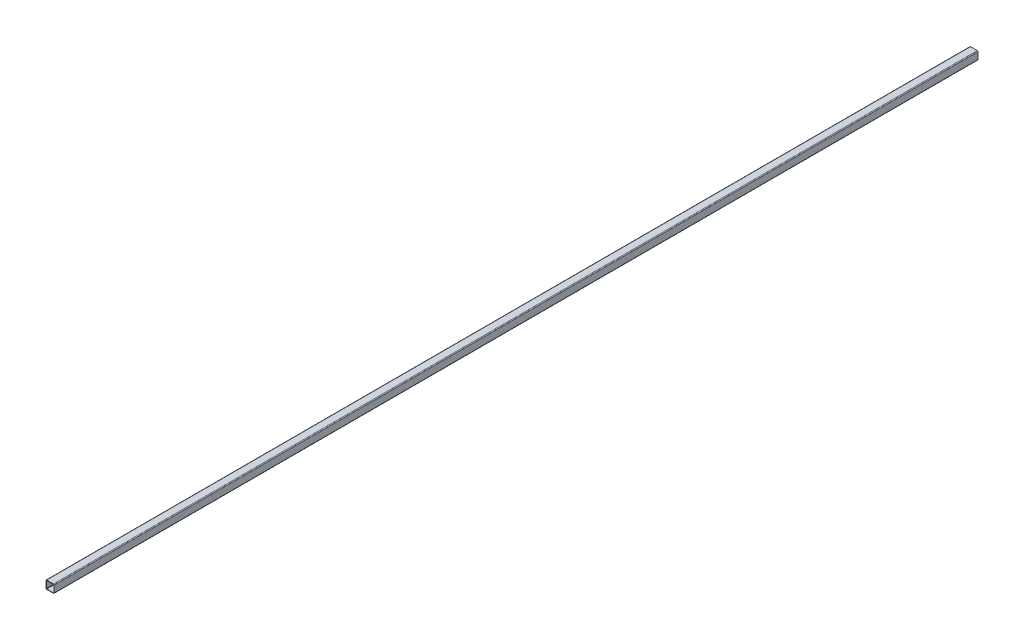
ISO-10303-21;
HEADER;
FILE_DESCRIPTION(('STEP AP214'),'2;1');
FILE_NAME('part.step','',(''),(''),'','','');
FILE_SCHEMA(('AUTOMOTIVE_DESIGN { 1 0 10303 214 1 1 1 1 }'));
ENDSEC;
DATA;
#1=APPLICATION_CONTEXT('core data for automotive mechanical design processes');
#2=APPLICATION_PROTOCOL_DEFINITION('international standard','automotive_design',2000,#1);
#3=PRODUCT_CONTEXT('',#1,'mechanical');
#4=PRODUCT('Part','Part','',(#3));
#5=PRODUCT_RELATED_PRODUCT_CATEGORY('part','',(#4));
#6=PRODUCT_DEFINITION_FORMATION('','',#4);
#7=PRODUCT_DEFINITION_CONTEXT('part definition',#1,'design');
#8=PRODUCT_DEFINITION('design','',#6,#7);
#9=PRODUCT_DEFINITION_SHAPE('','',#8);
#10=(LENGTH_UNIT() NAMED_UNIT(*) SI_UNIT(.MILLI.,.METRE.));
#11=(NAMED_UNIT(*) PLANE_ANGLE_UNIT() SI_UNIT($,.RADIAN.));
#12=(NAMED_UNIT(*) SI_UNIT($,.STERADIAN.) SOLID_ANGLE_UNIT());
#13=UNCERTAINTY_MEASURE_WITH_UNIT(LENGTH_MEASURE(1.E-05),#10,'distance_accuracy_value','');
#14=(GEOMETRIC_REPRESENTATION_CONTEXT(3) GLOBAL_UNCERTAINTY_ASSIGNED_CONTEXT((#13)) GLOBAL_UNIT_ASSIGNED_CONTEXT((#10,
#11,#12)) REPRESENTATION_CONTEXT('',''));
#15=CARTESIAN_POINT('',(0.,0.,0.));
#16=DIRECTION('',(0.,0.,1.));
#17=DIRECTION('',(1.,0.,0.));
#18=AXIS2_PLACEMENT_3D('',#15,#16,#17);
#19=CARTESIAN_POINT('',(-11.2903,-11.2903,1563.6875));
#20=DIRECTION('',(0.,0.,1.));
#21=DIRECTION('',(1.,0.,0.));
#22=AXIS2_PLACEMENT_3D('',#19,#20,#21);
#23=PLANE('',#22);
#24=CARTESIAN_POINT('',(-11.2903,-11.2903,1563.6875));
#25=DIRECTION('',(0.,0.,1.));
#26=DIRECTION('',(1.,0.,0.));
#27=AXIS2_PLACEMENT_3D('',#24,#25,#26);
#28=CIRCLE('',#27,2.54);
#29=CARTESIAN_POINT('',(-13.8303,-11.2903,1563.6875));
#30=VERTEX_POINT('',#29);
#31=CARTESIAN_POINT('',(-11.2903,-13.8303,1563.6875));
#32=VERTEX_POINT('',#31);
#33=EDGE_CURVE('E211',#30,#32,#28,.T.);
#34=ORIENTED_EDGE('',*,*,#33,.T.);
#35=DIRECTION('',(1.,0.,0.));
#36=VECTOR('',#35,1.);
#37=CARTESIAN_POINT('',(-11.2903,-13.8303,1563.6875));
#38=LINE('',#37,#36);
#39=CARTESIAN_POINT('',(11.2903,-13.8303,1563.6875));
#40=VERTEX_POINT('',#39);
#41=EDGE_CURVE('E214',#32,#40,#38,.T.);
#42=ORIENTED_EDGE('',*,*,#41,.T.);
#43=CARTESIAN_POINT('',(11.2903,-11.2903,1563.6875));
#44=DIRECTION('',(0.,0.,1.));
#45=DIRECTION('',(1.,0.,0.));
#46=AXIS2_PLACEMENT_3D('',#43,#44,#45);
#47=CIRCLE('',#46,2.53999999999999);
#48=CARTESIAN_POINT('',(13.8303,-11.2903,1563.6875));
#49=VERTEX_POINT('',#48);
#50=EDGE_CURVE('E217',#40,#49,#47,.T.);
#51=ORIENTED_EDGE('',*,*,#50,.T.);
#52=DIRECTION('',(0.,1.,0.));
#53=VECTOR('',#52,1.);
#54=CARTESIAN_POINT('',(13.8303,11.2903,1563.6875));
#55=LINE('',#54,#53);
#56=CARTESIAN_POINT('',(13.8303,11.2903,1563.6875));
#57=VERTEX_POINT('',#56);
#58=EDGE_CURVE('E219',#49,#57,#55,.T.);
#59=ORIENTED_EDGE('',*,*,#58,.T.);
#60=CARTESIAN_POINT('',(11.2903,11.2903,1563.6875));
#61=DIRECTION('',(0.,0.,1.));
#62=DIRECTION('',(-1.,0.,0.));
#63=AXIS2_PLACEMENT_3D('',#60,#61,#62);
#64=CIRCLE('',#63,2.53999999999999);
#65=CARTESIAN_POINT('',(11.2903,13.8303,1563.6875));
#66=VERTEX_POINT('',#65);
#67=EDGE_CURVE('E221',#57,#66,#64,.T.);
#68=ORIENTED_EDGE('',*,*,#67,.T.);
#69=DIRECTION('',(-1.,0.,0.));
#70=VECTOR('',#69,1.);
#71=CARTESIAN_POINT('',(-11.2903,13.8303,1563.6875));
#72=LINE('',#71,#70);
#73=CARTESIAN_POINT('',(-11.2903,13.8303,1563.6875));
#74=VERTEX_POINT('',#73);
#75=EDGE_CURVE('E223',#66,#74,#72,.T.);
#76=ORIENTED_EDGE('',*,*,#75,.T.);
#77=CARTESIAN_POINT('',(-11.2903,11.2903,1563.6875));
#78=DIRECTION('',(0.,0.,1.));
#79=DIRECTION('',(1.,0.,0.));
#80=AXIS2_PLACEMENT_3D('',#77,#78,#79);
#81=CIRCLE('',#80,2.54);
#82=CARTESIAN_POINT('',(-13.8303,11.2903,1563.6875));
#83=VERTEX_POINT('',#82);
#84=EDGE_CURVE('E225',#74,#83,#81,.T.);
#85=ORIENTED_EDGE('',*,*,#84,.T.);
#86=DIRECTION('',(0.,-1.,0.));
#87=VECTOR('',#86,1.);
#88=CARTESIAN_POINT('',(-13.8303,11.2903,1563.6875));
#89=LINE('',#88,#87);
#90=EDGE_CURVE('E227',#83,#30,#89,.T.);
#91=ORIENTED_EDGE('',*,*,#90,.T.);
#92=EDGE_LOOP('',(#34,#42,#51,#59,#68,#76,#85,#91));
#93=FACE_BOUND('',#92,.T.);
#94=DIRECTION('',(0.,-1.,0.));
#95=VECTOR('',#94,1.);
#96=CARTESIAN_POINT('',(-12.5603,11.2903,1563.6875));
#97=LINE('',#96,#95);
#98=CARTESIAN_POINT('',(-12.5603,11.2903,1563.6875));
#99=VERTEX_POINT('',#98);
#100=CARTESIAN_POINT('',(-12.5603,-11.2903,1563.6875));
#101=VERTEX_POINT('',#100);
#102=EDGE_CURVE('E154',#99,#101,#97,.T.);
#103=ORIENTED_EDGE('',*,*,#102,.F.);
#104=CARTESIAN_POINT('',(-11.2903,11.2903,1563.6875));
#105=DIRECTION('',(0.,0.,1.));
#106=DIRECTION('',(1.,0.,0.));
#107=AXIS2_PLACEMENT_3D('',#104,#105,#106);
#108=CIRCLE('',#107,1.27);
#109=CARTESIAN_POINT('',(-11.2903,12.5603,1563.6875));
#110=VERTEX_POINT('',#109);
#111=EDGE_CURVE('E146',#110,#99,#108,.T.);
#112=ORIENTED_EDGE('',*,*,#111,.F.);
#113=DIRECTION('',(-1.,0.,0.));
#114=VECTOR('',#113,1.);
#115=CARTESIAN_POINT('',(-11.2903,12.5603,1563.6875));
#116=LINE('',#115,#114);
#117=CARTESIAN_POINT('',(11.2903,12.5603,1563.6875));
#118=VERTEX_POINT('',#117);
#119=EDGE_CURVE('E179',#118,#110,#116,.T.);
#120=ORIENTED_EDGE('',*,*,#119,.F.);
#121=CARTESIAN_POINT('',(11.2903,11.2903,1563.6875));
#122=DIRECTION('',(0.,0.,1.));
#123=DIRECTION('',(-1.,0.,0.));
#124=AXIS2_PLACEMENT_3D('',#121,#122,#123);
#125=CIRCLE('',#124,1.26999999999999);
#126=CARTESIAN_POINT('',(12.5603,11.2903,1563.6875));
#127=VERTEX_POINT('',#126);
#128=EDGE_CURVE('E177',#127,#118,#125,.T.);
#129=ORIENTED_EDGE('',*,*,#128,.F.);
#130=DIRECTION('',(0.,1.,0.));
#131=VECTOR('',#130,1.);
#132=CARTESIAN_POINT('',(12.5603,11.2903,1563.6875));
#133=LINE('',#132,#131);
#134=CARTESIAN_POINT('',(12.5603,-11.2903,1563.6875));
#135=VERTEX_POINT('',#134);
#136=EDGE_CURVE('E175',#135,#127,#133,.T.);
#137=ORIENTED_EDGE('',*,*,#136,.F.);
#138=CARTESIAN_POINT('',(11.2903,-11.2903,1563.6875));
#139=DIRECTION('',(0.,0.,1.));
#140=DIRECTION('',(1.,0.,0.));
#141=AXIS2_PLACEMENT_3D('',#138,#139,#140);
#142=CIRCLE('',#141,1.27);
#143=CARTESIAN_POINT('',(11.2903,-12.5603,1563.6875));
#144=VERTEX_POINT('',#143);
#145=EDGE_CURVE('E173',#144,#135,#142,.T.);
#146=ORIENTED_EDGE('',*,*,#145,.F.);
#147=DIRECTION('',(1.,0.,0.));
#148=VECTOR('',#147,1.);
#149=CARTESIAN_POINT('',(-11.2903,-12.5603,1563.6875));
#150=LINE('',#149,#148);
#151=CARTESIAN_POINT('',(-11.2903,-12.5603,1563.6875));
#152=VERTEX_POINT('',#151);
#153=EDGE_CURVE('E169',#152,#144,#150,.T.);
#154=ORIENTED_EDGE('',*,*,#153,.F.);
#155=CARTESIAN_POINT('',(-11.2903,-11.2903,1563.6875));
#156=DIRECTION('',(0.,0.,1.));
#157=DIRECTION('',(1.,0.,0.));
#158=AXIS2_PLACEMENT_3D('',#155,#156,#157);
#159=CIRCLE('',#158,1.27);
#160=EDGE_CURVE('E167',#101,#152,#159,.T.);
#161=ORIENTED_EDGE('',*,*,#160,.F.);
#162=EDGE_LOOP('',(#103,#112,#120,#129,#137,#146,#154,#161));
#163=FACE_BOUND('',#162,.T.);
#164=ADVANCED_FACE('F33',(#93,#163),#23,.T.);
#165=CARTESIAN_POINT('',(-11.2903,-11.2903,-1563.6875));
#166=DIRECTION('',(0.,0.,1.));
#167=DIRECTION('',(1.,0.,0.));
#168=AXIS2_PLACEMENT_3D('',#165,#166,#167);
#169=PLANE('',#168);
#170=CARTESIAN_POINT('',(-11.2903,-11.2903,-1563.6875));
#171=DIRECTION('',(0.,0.,1.));
#172=DIRECTION('',(1.,0.,0.));
#173=AXIS2_PLACEMENT_3D('',#170,#171,#172);
#174=CIRCLE('',#173,2.54);
#175=CARTESIAN_POINT('',(-13.8303,-11.2903,-1563.6875));
#176=VERTEX_POINT('',#175);
#177=CARTESIAN_POINT('',(-11.2903,-13.8303,-1563.6875));
#178=VERTEX_POINT('',#177);
#179=EDGE_CURVE('E162',#176,#178,#174,.T.);
#180=ORIENTED_EDGE('',*,*,#179,.F.);
#181=DIRECTION('',(0.,-1.,0.));
#182=VECTOR('',#181,1.);
#183=CARTESIAN_POINT('',(-13.8303,11.2903,-1563.6875));
#184=LINE('',#183,#182);
#185=CARTESIAN_POINT('',(-13.8303,11.2903,-1563.6875));
#186=VERTEX_POINT('',#185);
#187=EDGE_CURVE('E215',#186,#176,#184,.T.);
#188=ORIENTED_EDGE('',*,*,#187,.F.);
#189=CARTESIAN_POINT('',(-11.2903,11.2903,-1563.6875));
#190=DIRECTION('',(0.,0.,1.));
#191=DIRECTION('',(1.,0.,0.));
#192=AXIS2_PLACEMENT_3D('',#189,#190,#191);
#193=CIRCLE('',#192,2.54);
#194=CARTESIAN_POINT('',(-11.2903,13.8303,-1563.6875));
#195=VERTEX_POINT('',#194);
#196=EDGE_CURVE('E242',#195,#186,#193,.T.);
#197=ORIENTED_EDGE('',*,*,#196,.F.);
#198=DIRECTION('',(-1.,0.,0.));
#199=VECTOR('',#198,1.);
#200=CARTESIAN_POINT('',(-11.2903,13.8303,-1563.6875));
#201=LINE('',#200,#199);
#202=CARTESIAN_POINT('',(11.2903,13.8303,-1563.6875));
#203=VERTEX_POINT('',#202);
#204=EDGE_CURVE('E240',#203,#195,#201,.T.);
#205=ORIENTED_EDGE('',*,*,#204,.F.);
#206=CARTESIAN_POINT('',(11.2903,11.2903,-1563.6875));
#207=DIRECTION('',(0.,0.,1.));
#208=DIRECTION('',(-1.,0.,0.));
#209=AXIS2_PLACEMENT_3D('',#206,#207,#208);
#210=CIRCLE('',#209,2.53999999999999);
#211=CARTESIAN_POINT('',(13.8303,11.2903,-1563.6875));
#212=VERTEX_POINT('',#211);
#213=EDGE_CURVE('E238',#212,#203,#210,.T.);
#214=ORIENTED_EDGE('',*,*,#213,.F.);
#215=DIRECTION('',(0.,1.,0.));
#216=VECTOR('',#215,1.);
#217=CARTESIAN_POINT('',(13.8303,11.2903,-1563.6875));
#218=LINE('',#217,#216);
#219=CARTESIAN_POINT('',(13.8303,-11.2903,-1563.6875));
#220=VERTEX_POINT('',#219);
#221=EDGE_CURVE('E236',#220,#212,#218,.T.);
#222=ORIENTED_EDGE('',*,*,#221,.F.);
#223=CARTESIAN_POINT('',(11.2903,-11.2903,-1563.6875));
#224=DIRECTION('',(0.,0.,1.));
#225=DIRECTION('',(1.,0.,0.));
#226=AXIS2_PLACEMENT_3D('',#223,#224,#225);
#227=CIRCLE('',#226,2.53999999999999);
#228=CARTESIAN_POINT('',(11.2903,-13.8303,-1563.6875));
#229=VERTEX_POINT('',#228);
#230=EDGE_CURVE('E234',#229,#220,#227,.T.);
#231=ORIENTED_EDGE('',*,*,#230,.F.);
#232=DIRECTION('',(1.,0.,0.));
#233=VECTOR('',#232,1.);
#234=CARTESIAN_POINT('',(-11.2903,-13.8303,-1563.6875));
#235=LINE('',#234,#233);
#236=EDGE_CURVE('E232',#178,#229,#235,.T.);
#237=ORIENTED_EDGE('',*,*,#236,.F.);
#238=EDGE_LOOP('',(#180,#188,#197,#205,#214,#222,#231,#237));
#239=FACE_BOUND('',#238,.T.);
#240=CARTESIAN_POINT('',(-11.2903,11.2903,-1563.6875));
#241=DIRECTION('',(0.,0.,1.));
#242=DIRECTION('',(1.,0.,0.));
#243=AXIS2_PLACEMENT_3D('',#240,#241,#242);
#244=CIRCLE('',#243,1.27);
#245=CARTESIAN_POINT('',(-11.2903,12.5603,-1563.6875));
#246=VERTEX_POINT('',#245);
#247=CARTESIAN_POINT('',(-12.5603,11.2903,-1563.6875));
#248=VERTEX_POINT('',#247);
#249=EDGE_CURVE('E56',#246,#248,#244,.T.);
#250=ORIENTED_EDGE('',*,*,#249,.T.);
#251=DIRECTION('',(0.,-1.,0.));
#252=VECTOR('',#251,1.);
#253=CARTESIAN_POINT('',(-12.5603,11.2903,-1563.6875));
#254=LINE('',#253,#252);
#255=CARTESIAN_POINT('',(-12.5603,-11.2903,-1563.6875));
#256=VERTEX_POINT('',#255);
#257=EDGE_CURVE('E161',#248,#256,#254,.T.);
#258=ORIENTED_EDGE('',*,*,#257,.T.);
#259=CARTESIAN_POINT('',(-11.2903,-11.2903,-1563.6875));
#260=DIRECTION('',(0.,0.,1.));
#261=DIRECTION('',(1.,0.,0.));
#262=AXIS2_PLACEMENT_3D('',#259,#260,#261);
#263=CIRCLE('',#262,1.27);
#264=CARTESIAN_POINT('',(-11.2903,-12.5603,-1563.6875));
#265=VERTEX_POINT('',#264);
#266=EDGE_CURVE('E183',#256,#265,#263,.T.);
#267=ORIENTED_EDGE('',*,*,#266,.T.);
#268=DIRECTION('',(1.,0.,0.));
#269=VECTOR('',#268,1.);
#270=CARTESIAN_POINT('',(-11.2903,-12.5603,-1563.6875));
#271=LINE('',#270,#269);
#272=CARTESIAN_POINT('',(11.2903,-12.5603,-1563.6875));
#273=VERTEX_POINT('',#272);
#274=EDGE_CURVE('E186',#265,#273,#271,.T.);
#275=ORIENTED_EDGE('',*,*,#274,.T.);
#276=CARTESIAN_POINT('',(11.2903,-11.2903,-1563.6875));
#277=DIRECTION('',(0.,0.,1.));
#278=DIRECTION('',(1.,0.,0.));
#279=AXIS2_PLACEMENT_3D('',#276,#277,#278);
#280=CIRCLE('',#279,1.27);
#281=CARTESIAN_POINT('',(12.5603,-11.2903,-1563.6875));
#282=VERTEX_POINT('',#281);
#283=EDGE_CURVE('E189',#273,#282,#280,.T.);
#284=ORIENTED_EDGE('',*,*,#283,.T.);
#285=DIRECTION('',(0.,1.,0.));
#286=VECTOR('',#285,1.);
#287=CARTESIAN_POINT('',(12.5603,11.2903,-1563.6875));
#288=LINE('',#287,#286);
#289=CARTESIAN_POINT('',(12.5603,11.2903,-1563.6875));
#290=VERTEX_POINT('',#289);
#291=EDGE_CURVE('E192',#282,#290,#288,.T.);
#292=ORIENTED_EDGE('',*,*,#291,.T.);
#293=CARTESIAN_POINT('',(11.2903,11.2903,-1563.6875));
#294=DIRECTION('',(0.,0.,1.));
#295=DIRECTION('',(-1.,0.,0.));
#296=AXIS2_PLACEMENT_3D('',#293,#294,#295);
#297=CIRCLE('',#296,1.26999999999999);
#298=CARTESIAN_POINT('',(11.2903,12.5603,-1563.6875));
#299=VERTEX_POINT('',#298);
#300=EDGE_CURVE('E195',#290,#299,#297,.T.);
#301=ORIENTED_EDGE('',*,*,#300,.T.);
#302=DIRECTION('',(-1.,0.,0.));
#303=VECTOR('',#302,1.);
#304=CARTESIAN_POINT('',(-11.2903,12.5603,-1563.6875));
#305=LINE('',#304,#303);
#306=EDGE_CURVE('E155',#299,#246,#305,.T.);
#307=ORIENTED_EDGE('',*,*,#306,.T.);
#308=EDGE_LOOP('',(#250,#258,#267,#275,#284,#292,#301,#307));
#309=FACE_BOUND('',#308,.T.);
#310=ADVANCED_FACE('F272',(#239,#309),#169,.F.);
#311=CARTESIAN_POINT('',(-11.2903,-11.2903,1563.6875));
#312=DIRECTION('',(0.,0.,-1.));
#313=DIRECTION('',(-1.,0.,0.));
#314=AXIS2_PLACEMENT_3D('',#311,#312,#313);
#315=CYLINDRICAL_SURFACE('',#314,2.54);
#316=ORIENTED_EDGE('',*,*,#179,.T.);
#317=DIRECTION('',(0.,0.,-1.));
#318=VECTOR('',#317,1.);
#319=CARTESIAN_POINT('',(-11.2903,-13.8303,1563.6875));
#320=LINE('',#319,#318);
#321=EDGE_CURVE('E11',#32,#178,#320,.T.);
#322=ORIENTED_EDGE('',*,*,#321,.F.);
#323=ORIENTED_EDGE('',*,*,#33,.F.);
#324=DIRECTION('',(0.,0.,-1.));
#325=VECTOR('',#324,1.);
#326=CARTESIAN_POINT('',(-13.8303,-11.2903,1563.6875));
#327=LINE('',#326,#325);
#328=EDGE_CURVE('E229',#30,#176,#327,.T.);
#329=ORIENTED_EDGE('',*,*,#328,.T.);
#330=EDGE_LOOP('',(#316,#322,#323,#329));
#331=FACE_BOUND('',#330,.T.);
#332=ADVANCED_FACE('F35',(#331),#315,.T.);
#333=CARTESIAN_POINT('',(-11.2903,-13.8303,1563.6875));
#334=DIRECTION('',(0.,1.,0.));
#335=DIRECTION('',(0.,0.,1.));
#336=AXIS2_PLACEMENT_3D('',#333,#334,#335);
#337=PLANE('',#336);
#338=ORIENTED_EDGE('',*,*,#236,.T.);
#339=DIRECTION('',(0.,0.,-1.));
#340=VECTOR('',#339,1.);
#341=CARTESIAN_POINT('',(11.2903,-13.8303,1563.6875));
#342=LINE('',#341,#340);
#343=EDGE_CURVE('E41',#40,#229,#342,.T.);
#344=ORIENTED_EDGE('',*,*,#343,.F.);
#345=ORIENTED_EDGE('',*,*,#41,.F.);
#346=ORIENTED_EDGE('',*,*,#321,.T.);
#347=EDGE_LOOP('',(#338,#344,#345,#346));
#348=FACE_BOUND('',#347,.T.);
#349=ADVANCED_FACE('F289',(#348),#337,.F.);
#350=CARTESIAN_POINT('',(11.2903,-11.2903,1563.6875));
#351=DIRECTION('',(0.,0.,-1.));
#352=DIRECTION('',(-1.,0.,0.));
#353=AXIS2_PLACEMENT_3D('',#350,#351,#352);
#354=CYLINDRICAL_SURFACE('',#353,2.53999999999999);
#355=ORIENTED_EDGE('',*,*,#230,.T.);
#356=DIRECTION('',(0.,0.,-1.));
#357=VECTOR('',#356,1.);
#358=CARTESIAN_POINT('',(13.8303,-11.2903,1563.6875));
#359=LINE('',#358,#357);
#360=EDGE_CURVE('E259',#49,#220,#359,.T.);
#361=ORIENTED_EDGE('',*,*,#360,.F.);
#362=ORIENTED_EDGE('',*,*,#50,.F.);
#363=ORIENTED_EDGE('',*,*,#343,.T.);
#364=EDGE_LOOP('',(#355,#361,#362,#363));
#365=FACE_BOUND('',#364,.T.);
#366=ADVANCED_FACE('F266',(#365),#354,.T.);
#367=CARTESIAN_POINT('',(13.8303,11.2903,1563.6875));
#368=DIRECTION('',(-1.,0.,0.));
#369=DIRECTION('',(0.,0.,1.));
#370=AXIS2_PLACEMENT_3D('',#367,#368,#369);
#371=PLANE('',#370);
#372=ORIENTED_EDGE('',*,*,#221,.T.);
#373=DIRECTION('',(0.,0.,-1.));
#374=VECTOR('',#373,1.);
#375=CARTESIAN_POINT('',(13.8303,11.2903,1563.6875));
#376=LINE('',#375,#374);
#377=EDGE_CURVE('E256',#57,#212,#376,.T.);
#378=ORIENTED_EDGE('',*,*,#377,.F.);
#379=ORIENTED_EDGE('',*,*,#58,.F.);
#380=ORIENTED_EDGE('',*,*,#360,.T.);
#381=EDGE_LOOP('',(#372,#378,#379,#380));
#382=FACE_BOUND('',#381,.T.);
#383=ADVANCED_FACE('F278',(#382),#371,.F.);
#384=CARTESIAN_POINT('',(11.2903,11.2903,1563.6875));
#385=DIRECTION('',(0.,0.,-1.));
#386=DIRECTION('',(-1.,0.,0.));
#387=AXIS2_PLACEMENT_3D('',#384,#385,#386);
#388=CYLINDRICAL_SURFACE('',#387,2.53999999999999);
#389=ORIENTED_EDGE('',*,*,#213,.T.);
#390=DIRECTION('',(0.,0.,-1.));
#391=VECTOR('',#390,1.);
#392=CARTESIAN_POINT('',(11.2903,13.8303,1563.6875));
#393=LINE('',#392,#391);
#394=EDGE_CURVE('E253',#66,#203,#393,.T.);
#395=ORIENTED_EDGE('',*,*,#394,.F.);
#396=ORIENTED_EDGE('',*,*,#67,.F.);
#397=ORIENTED_EDGE('',*,*,#377,.T.);
#398=EDGE_LOOP('',(#389,#395,#396,#397));
#399=FACE_BOUND('',#398,.T.);
#400=ADVANCED_FACE('F282',(#399),#388,.T.);
#401=CARTESIAN_POINT('',(-11.2903,13.8303,1563.6875));
#402=DIRECTION('',(0.,-1.,0.));
#403=DIRECTION('',(0.,0.,-1.));
#404=AXIS2_PLACEMENT_3D('',#401,#402,#403);
#405=PLANE('',#404);
#406=ORIENTED_EDGE('',*,*,#204,.T.);
#407=DIRECTION('',(0.,0.,-1.));
#408=VECTOR('',#407,1.);
#409=CARTESIAN_POINT('',(-11.2903,13.8303,1563.6875));
#410=LINE('',#409,#408);
#411=EDGE_CURVE('E250',#74,#195,#410,.T.);
#412=ORIENTED_EDGE('',*,*,#411,.F.);
#413=ORIENTED_EDGE('',*,*,#75,.F.);
#414=ORIENTED_EDGE('',*,*,#394,.T.);
#415=EDGE_LOOP('',(#406,#412,#413,#414));
#416=FACE_BOUND('',#415,.T.);
#417=ADVANCED_FACE('F302',(#416),#405,.F.);
#418=CARTESIAN_POINT('',(-11.2903,11.2903,1563.6875));
#419=DIRECTION('',(0.,0.,-1.));
#420=DIRECTION('',(-1.,0.,0.));
#421=AXIS2_PLACEMENT_3D('',#418,#419,#420);
#422=CYLINDRICAL_SURFACE('',#421,2.54);
#423=ORIENTED_EDGE('',*,*,#196,.T.);
#424=DIRECTION('',(0.,0.,-1.));
#425=VECTOR('',#424,1.);
#426=CARTESIAN_POINT('',(-13.8303,11.2903,1563.6875));
#427=LINE('',#426,#425);
#428=EDGE_CURVE('E247',#83,#186,#427,.T.);
#429=ORIENTED_EDGE('',*,*,#428,.F.);
#430=ORIENTED_EDGE('',*,*,#84,.F.);
#431=ORIENTED_EDGE('',*,*,#411,.T.);
#432=EDGE_LOOP('',(#423,#429,#430,#431));
#433=FACE_BOUND('',#432,.T.);
#434=ADVANCED_FACE('F300',(#433),#422,.T.);
#435=CARTESIAN_POINT('',(-13.8303,11.2903,1563.6875));
#436=DIRECTION('',(1.,0.,0.));
#437=DIRECTION('',(0.,0.,-1.));
#438=AXIS2_PLACEMENT_3D('',#435,#436,#437);
#439=PLANE('',#438);
#440=ORIENTED_EDGE('',*,*,#187,.T.);
#441=ORIENTED_EDGE('',*,*,#328,.F.);
#442=ORIENTED_EDGE('',*,*,#90,.F.);
#443=ORIENTED_EDGE('',*,*,#428,.T.);
#444=EDGE_LOOP('',(#440,#441,#442,#443));
#445=FACE_BOUND('',#444,.T.);
#446=ADVANCED_FACE('F295',(#445),#439,.F.);
#447=CARTESIAN_POINT('',(-11.2903,11.2903,1563.6875));
#448=DIRECTION('',(0.,0.,-1.));
#449=DIRECTION('',(-1.,0.,0.));
#450=AXIS2_PLACEMENT_3D('',#447,#448,#449);
#451=CYLINDRICAL_SURFACE('',#450,1.27);
#452=ORIENTED_EDGE('',*,*,#249,.F.);
#453=DIRECTION('',(0.,0.,-1.));
#454=VECTOR('',#453,1.);
#455=CARTESIAN_POINT('',(-11.2903,12.5603,1563.6875));
#456=LINE('',#455,#454);
#457=EDGE_CURVE('E150',#110,#246,#456,.T.);
#458=ORIENTED_EDGE('',*,*,#457,.F.);
#459=ORIENTED_EDGE('',*,*,#111,.T.);
#460=DIRECTION('',(0.,0.,-1.));
#461=VECTOR('',#460,1.);
#462=CARTESIAN_POINT('',(-12.5603,11.2903,1563.6875));
#463=LINE('',#462,#461);
#464=EDGE_CURVE('E149',#99,#248,#463,.T.);
#465=ORIENTED_EDGE('',*,*,#464,.T.);
#466=EDGE_LOOP('',(#452,#458,#459,#465));
#467=FACE_BOUND('',#466,.T.);
#468=ADVANCED_FACE('F148',(#467),#451,.F.);
#469=CARTESIAN_POINT('',(-12.5603,11.2903,1563.6875));
#470=DIRECTION('',(1.,0.,0.));
#471=DIRECTION('',(0.,0.,-1.));
#472=AXIS2_PLACEMENT_3D('',#469,#470,#471);
#473=PLANE('',#472);
#474=ORIENTED_EDGE('',*,*,#257,.F.);
#475=ORIENTED_EDGE('',*,*,#464,.F.);
#476=ORIENTED_EDGE('',*,*,#102,.T.);
#477=DIRECTION('',(0.,0.,-1.));
#478=VECTOR('',#477,1.);
#479=CARTESIAN_POINT('',(-12.5603,-11.2903,1563.6875));
#480=LINE('',#479,#478);
#481=EDGE_CURVE('E163',#101,#256,#480,.T.);
#482=ORIENTED_EDGE('',*,*,#481,.T.);
#483=EDGE_LOOP('',(#474,#475,#476,#482));
#484=FACE_BOUND('',#483,.T.);
#485=ADVANCED_FACE('F158',(#484),#473,.T.);
#486=CARTESIAN_POINT('',(-11.2903,-11.2903,1563.6875));
#487=DIRECTION('',(0.,0.,-1.));
#488=DIRECTION('',(-1.,0.,0.));
#489=AXIS2_PLACEMENT_3D('',#486,#487,#488);
#490=CYLINDRICAL_SURFACE('',#489,1.27);
#491=ORIENTED_EDGE('',*,*,#266,.F.);
#492=ORIENTED_EDGE('',*,*,#481,.F.);
#493=ORIENTED_EDGE('',*,*,#160,.T.);
#494=DIRECTION('',(0.,0.,-1.));
#495=VECTOR('',#494,1.);
#496=CARTESIAN_POINT('',(-11.2903,-12.5603,1563.6875));
#497=LINE('',#496,#495);
#498=EDGE_CURVE('E208',#152,#265,#497,.T.);
#499=ORIENTED_EDGE('',*,*,#498,.T.);
#500=EDGE_LOOP('',(#491,#492,#493,#499));
#501=FACE_BOUND('',#500,.T.);
#502=ADVANCED_FACE('F327',(#501),#490,.F.);
#503=CARTESIAN_POINT('',(-11.2903,-12.5603,1563.6875));
#504=DIRECTION('',(0.,1.,0.));
#505=DIRECTION('',(0.,0.,1.));
#506=AXIS2_PLACEMENT_3D('',#503,#504,#505);
#507=PLANE('',#506);
#508=ORIENTED_EDGE('',*,*,#274,.F.);
#509=ORIENTED_EDGE('',*,*,#498,.F.);
#510=ORIENTED_EDGE('',*,*,#153,.T.);
#511=DIRECTION('',(0.,0.,-1.));
#512=VECTOR('',#511,1.);
#513=CARTESIAN_POINT('',(11.2903,-12.5603,1563.6875));
#514=LINE('',#513,#512);
#515=EDGE_CURVE('E206',#144,#273,#514,.T.);
#516=ORIENTED_EDGE('',*,*,#515,.T.);
#517=EDGE_LOOP('',(#508,#509,#510,#516));
#518=FACE_BOUND('',#517,.T.);
#519=ADVANCED_FACE('F331',(#518),#507,.T.);
#520=CARTESIAN_POINT('',(11.2903,-11.2903,1563.6875));
#521=DIRECTION('',(0.,0.,-1.));
#522=DIRECTION('',(-1.,0.,0.));
#523=AXIS2_PLACEMENT_3D('',#520,#521,#522);
#524=CYLINDRICAL_SURFACE('',#523,1.27);
#525=ORIENTED_EDGE('',*,*,#283,.F.);
#526=ORIENTED_EDGE('',*,*,#515,.F.);
#527=ORIENTED_EDGE('',*,*,#145,.T.);
#528=DIRECTION('',(0.,0.,-1.));
#529=VECTOR('',#528,1.);
#530=CARTESIAN_POINT('',(12.5603,-11.2903,1563.6875));
#531=LINE('',#530,#529);
#532=EDGE_CURVE('E204',#135,#282,#531,.T.);
#533=ORIENTED_EDGE('',*,*,#532,.T.);
#534=EDGE_LOOP('',(#525,#526,#527,#533));
#535=FACE_BOUND('',#534,.T.);
#536=ADVANCED_FACE('F337',(#535),#524,.F.);
#537=CARTESIAN_POINT('',(12.5603,11.2903,1563.6875));
#538=DIRECTION('',(-1.,0.,0.));
#539=DIRECTION('',(0.,-1.,0.));
#540=AXIS2_PLACEMENT_3D('',#537,#538,#539);
#541=PLANE('',#540);
#542=ORIENTED_EDGE('',*,*,#291,.F.);
#543=ORIENTED_EDGE('',*,*,#532,.F.);
#544=ORIENTED_EDGE('',*,*,#136,.T.);
#545=DIRECTION('',(0.,0.,-1.));
#546=VECTOR('',#545,1.);
#547=CARTESIAN_POINT('',(12.5603,11.2903,1563.6875));
#548=LINE('',#547,#546);
#549=EDGE_CURVE('E202',#127,#290,#548,.T.);
#550=ORIENTED_EDGE('',*,*,#549,.T.);
#551=EDGE_LOOP('',(#542,#543,#544,#550));
#552=FACE_BOUND('',#551,.T.);
#553=ADVANCED_FACE('F341',(#552),#541,.T.);
#554=CARTESIAN_POINT('',(11.2903,11.2903,1563.6875));
#555=DIRECTION('',(0.,0.,-1.));
#556=DIRECTION('',(-1.,0.,0.));
#557=AXIS2_PLACEMENT_3D('',#554,#555,#556);
#558=CYLINDRICAL_SURFACE('',#557,1.26999999999999);
#559=ORIENTED_EDGE('',*,*,#300,.F.);
#560=ORIENTED_EDGE('',*,*,#549,.F.);
#561=ORIENTED_EDGE('',*,*,#128,.T.);
#562=DIRECTION('',(0.,0.,-1.));
#563=VECTOR('',#562,1.);
#564=CARTESIAN_POINT('',(11.2903,12.5603,1563.6875));
#565=LINE('',#564,#563);
#566=EDGE_CURVE('E48',#118,#299,#565,.T.);
#567=ORIENTED_EDGE('',*,*,#566,.T.);
#568=EDGE_LOOP('',(#559,#560,#561,#567));
#569=FACE_BOUND('',#568,.T.);
#570=ADVANCED_FACE('F345',(#569),#558,.F.);
#571=CARTESIAN_POINT('',(-11.2903,12.5603,1563.6875));
#572=DIRECTION('',(0.,-1.,0.));
#573=DIRECTION('',(1.,0.,0.));
#574=AXIS2_PLACEMENT_3D('',#571,#572,#573);
#575=PLANE('',#574);
#576=ORIENTED_EDGE('',*,*,#306,.F.);
#577=ORIENTED_EDGE('',*,*,#566,.F.);
#578=ORIENTED_EDGE('',*,*,#119,.T.);
#579=ORIENTED_EDGE('',*,*,#457,.T.);
#580=EDGE_LOOP('',(#576,#577,#578,#579));
#581=FACE_BOUND('',#580,.T.);
#582=ADVANCED_FACE('F349',(#581),#575,.T.);
#583=CLOSED_SHELL('',(#164,#310,#332,#349,#366,#383,#400,#417,#434,#446,#468,#485,#502,#519,
#536,#553,#570,#582));
#584=MANIFOLD_SOLID_BREP('B2',#583);
#585=ADVANCED_BREP_SHAPE_REPRESENTATION('',(#18,#584),#14);
#586=SHAPE_DEFINITION_REPRESENTATION(#9,#585);
ENDSEC;
END-ISO-10303-21;
